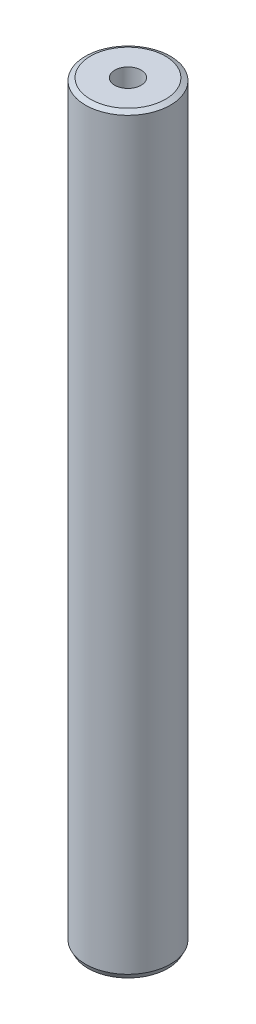
ISO-10303-21;
HEADER;
FILE_DESCRIPTION(('STEP AP214'),'2;1');
FILE_NAME('part.step','',(''),(''),'','','');
FILE_SCHEMA(('AUTOMOTIVE_DESIGN { 1 0 10303 214 1 1 1 1 }'));
ENDSEC;
DATA;
#1=APPLICATION_CONTEXT('core data for automotive mechanical design processes');
#2=APPLICATION_PROTOCOL_DEFINITION('international standard','automotive_design',2000,#1);
#3=PRODUCT_CONTEXT('',#1,'mechanical');
#4=PRODUCT('Part','Part','',(#3));
#5=PRODUCT_RELATED_PRODUCT_CATEGORY('part','',(#4));
#6=PRODUCT_DEFINITION_FORMATION('','',#4);
#7=PRODUCT_DEFINITION_CONTEXT('part definition',#1,'design');
#8=PRODUCT_DEFINITION('design','',#6,#7);
#9=PRODUCT_DEFINITION_SHAPE('','',#8);
#10=(LENGTH_UNIT() NAMED_UNIT(*) SI_UNIT(.MILLI.,.METRE.));
#11=(NAMED_UNIT(*) PLANE_ANGLE_UNIT() SI_UNIT($,.RADIAN.));
#12=(NAMED_UNIT(*) SI_UNIT($,.STERADIAN.) SOLID_ANGLE_UNIT());
#13=UNCERTAINTY_MEASURE_WITH_UNIT(LENGTH_MEASURE(1.E-05),#10,'distance_accuracy_value','');
#14=(GEOMETRIC_REPRESENTATION_CONTEXT(3) GLOBAL_UNCERTAINTY_ASSIGNED_CONTEXT((#13)) GLOBAL_UNIT_ASSIGNED_CONTEXT((#10,
#11,#12)) REPRESENTATION_CONTEXT('',''));
#15=CARTESIAN_POINT('',(0.,0.,0.));
#16=DIRECTION('',(0.,0.,1.));
#17=DIRECTION('',(1.,0.,0.));
#18=AXIS2_PLACEMENT_3D('',#15,#16,#17);
#19=CARTESIAN_POINT('',(0.,88.4913036678327,0.));
#20=DIRECTION('',(0.,-1.,0.));
#21=DIRECTION('',(0.,0.,-1.));
#22=AXIS2_PLACEMENT_3D('',#19,#20,#21);
#23=CYLINDRICAL_SURFACE('',#22,5.);
#24=CARTESIAN_POINT('',(0.,88.1893558262009,0.));
#25=DIRECTION('',(0.,1.,0.));
#26=DIRECTION('',(0.,0.,1.));
#27=AXIS2_PLACEMENT_3D('',#24,#25,#26);
#28=CIRCLE('',#27,5.);
#29=CARTESIAN_POINT('',(0.,88.1893558262009,5.));
#30=VERTEX_POINT('',#29);
#31=EDGE_CURVE('E50',#30,#30,#28,.F.);
#32=ORIENTED_EDGE('',*,*,#31,.T.);
#33=EDGE_LOOP('',(#32));
#34=FACE_BOUND('',#33,.T.);
#35=CARTESIAN_POINT('',(0.,0.590605177129722,0.));
#36=DIRECTION('',(0.,1.,0.));
#37=DIRECTION('',(0.,0.,1.));
#38=AXIS2_PLACEMENT_3D('',#35,#36,#37);
#39=CIRCLE('',#38,5.);
#40=CARTESIAN_POINT('',(0.,0.590605177129722,5.));
#41=VERTEX_POINT('',#40);
#42=EDGE_CURVE('E51',#41,#41,#39,.T.);
#43=ORIENTED_EDGE('',*,*,#42,.T.);
#44=EDGE_LOOP('',(#43));
#45=FACE_BOUND('',#44,.T.);
#46=ADVANCED_FACE('F39',(#34,#45),#23,.T.);
#47=CARTESIAN_POINT('',(0.,88.4913036678327,0.));
#48=DIRECTION('',(0.,1.,0.));
#49=DIRECTION('',(0.,0.,1.));
#50=AXIS2_PLACEMENT_3D('',#47,#48,#49);
#51=PLANE('',#50);
#52=CARTESIAN_POINT('',(0.,88.4913036678327,0.));
#53=DIRECTION('',(0.,1.,0.));
#54=DIRECTION('',(0.,0.,1.));
#55=AXIS2_PLACEMENT_3D('',#52,#53,#54);
#56=CIRCLE('',#55,4.40939482287021);
#57=CARTESIAN_POINT('',(0.,88.4913036678327,4.40939482287021));
#58=VERTEX_POINT('',#57);
#59=EDGE_CURVE('E54',#58,#58,#56,.T.);
#60=ORIENTED_EDGE('',*,*,#59,.T.);
#61=EDGE_LOOP('',(#60));
#62=FACE_BOUND('',#61,.T.);
#63=CARTESIAN_POINT('',(0.,88.4913036678327,0.));
#64=DIRECTION('',(0.,1.,0.));
#65=DIRECTION('',(0.,0.,1.));
#66=AXIS2_PLACEMENT_3D('',#63,#64,#65);
#67=CIRCLE('',#66,1.55200639744642);
#68=CARTESIAN_POINT('',(0.,88.4913036678327,1.55200639744642));
#69=VERTEX_POINT('',#68);
#70=EDGE_CURVE('E58',#69,#69,#67,.T.);
#71=ORIENTED_EDGE('',*,*,#70,.F.);
#72=EDGE_LOOP('',(#71));
#73=FACE_BOUND('',#72,.T.);
#74=ADVANCED_FACE('F69',(#62,#73),#51,.T.);
#75=CARTESIAN_POINT('',(0.,0.,0.));
#76=DIRECTION('',(0.,1.,0.));
#77=DIRECTION('',(0.,0.,1.));
#78=AXIS2_PLACEMENT_3D('',#75,#76,#77);
#79=PLANE('',#78);
#80=CARTESIAN_POINT('',(0.,0.,0.));
#81=DIRECTION('',(0.,1.,0.));
#82=DIRECTION('',(0.,0.,1.));
#83=AXIS2_PLACEMENT_3D('',#80,#81,#82);
#84=CIRCLE('',#83,4.69805215836828);
#85=CARTESIAN_POINT('',(0.,0.,4.69805215836828));
#86=VERTEX_POINT('',#85);
#87=EDGE_CURVE('E10',#86,#86,#84,.F.);
#88=ORIENTED_EDGE('',*,*,#87,.T.);
#89=EDGE_LOOP('',(#88));
#90=FACE_BOUND('',#89,.T.);
#91=CARTESIAN_POINT('',(0.,0.,0.));
#92=DIRECTION('',(0.,1.,0.));
#93=DIRECTION('',(0.,0.,1.));
#94=AXIS2_PLACEMENT_3D('',#91,#92,#93);
#95=CIRCLE('',#94,1.55200639744642);
#96=CARTESIAN_POINT('',(0.,0.,1.55200639744642));
#97=VERTEX_POINT('',#96);
#98=EDGE_CURVE('E63',#97,#97,#95,.T.);
#99=ORIENTED_EDGE('',*,*,#98,.T.);
#100=EDGE_LOOP('',(#99));
#101=FACE_BOUND('',#100,.T.);
#102=ADVANCED_FACE('F75',(#90,#101),#79,.F.);
#103=CARTESIAN_POINT('',(0.,88.4913036678327,0.));
#104=DIRECTION('',(0.,-1.,0.));
#105=DIRECTION('',(0.,0.,-1.));
#106=AXIS2_PLACEMENT_3D('',#103,#104,#105);
#107=CYLINDRICAL_SURFACE('',#106,1.55200639744642);
#108=ORIENTED_EDGE('',*,*,#70,.T.);
#109=EDGE_LOOP('',(#108));
#110=FACE_BOUND('',#109,.T.);
#111=ORIENTED_EDGE('',*,*,#98,.F.);
#112=EDGE_LOOP('',(#111));
#113=FACE_BOUND('',#112,.T.);
#114=ADVANCED_FACE('F70',(#110,#113),#107,.F.);
#115=CARTESIAN_POINT('',(0.,88.4913036678327,0.));
#116=DIRECTION('',(0.,-1.,0.));
#117=DIRECTION('',(0.,0.,-1.));
#118=AXIS2_PLACEMENT_3D('',#115,#116,#117);
#119=CONICAL_SURFACE('',#118,4.40939482287021,1.09818800783663);
#120=ORIENTED_EDGE('',*,*,#31,.F.);
#121=EDGE_LOOP('',(#120));
#122=FACE_BOUND('',#121,.T.);
#123=ORIENTED_EDGE('',*,*,#59,.F.);
#124=EDGE_LOOP('',(#123));
#125=FACE_BOUND('',#124,.T.);
#126=ADVANCED_FACE('F81',(#122,#125),#119,.T.);
#127=CARTESIAN_POINT('',(0.,0.590605177129722,0.));
#128=DIRECTION('',(0.,1.,0.));
#129=DIRECTION('',(0.,0.,1.));
#130=AXIS2_PLACEMENT_3D('',#127,#128,#129);
#131=CONICAL_SURFACE('',#130,5.,0.472608318958273);
#132=ORIENTED_EDGE('',*,*,#87,.F.);
#133=EDGE_LOOP('',(#132));
#134=FACE_BOUND('',#133,.T.);
#135=ORIENTED_EDGE('',*,*,#42,.F.);
#136=EDGE_LOOP('',(#135));
#137=FACE_BOUND('',#136,.T.);
#138=ADVANCED_FACE('F45',(#134,#137),#131,.T.);
#139=CLOSED_SHELL('',(#46,#74,#102,#114,#126,#138));
#140=MANIFOLD_SOLID_BREP('B2',#139);
#141=ADVANCED_BREP_SHAPE_REPRESENTATION('',(#18,#140),#14);
#142=SHAPE_DEFINITION_REPRESENTATION(#9,#141);
ENDSEC;
END-ISO-10303-21;
